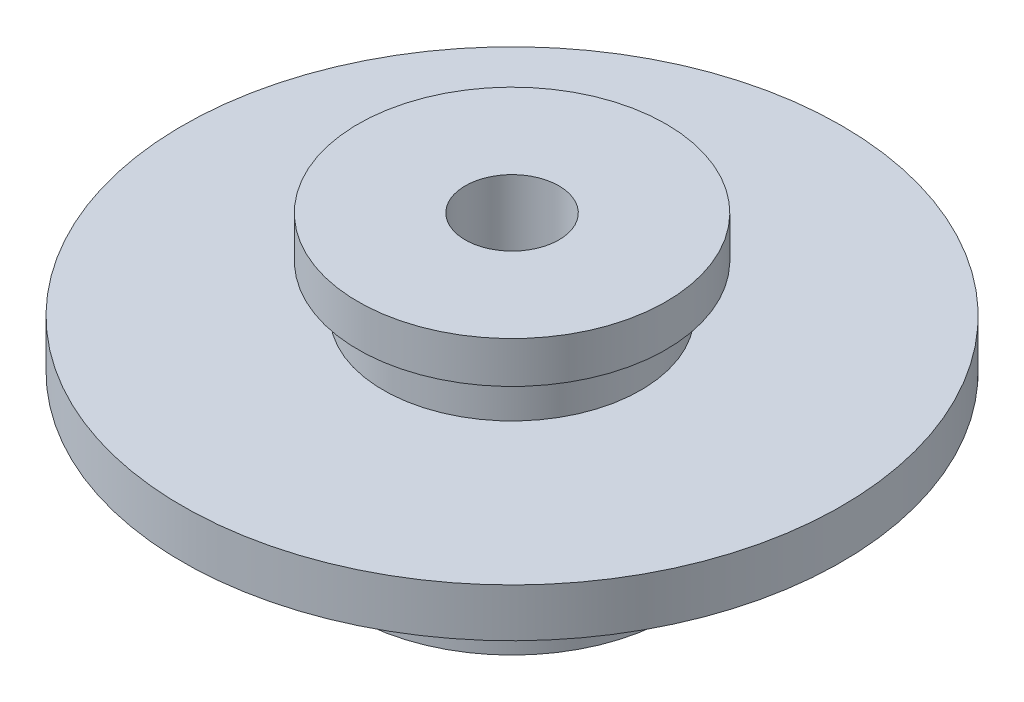
ISO-10303-21;
HEADER;
FILE_DESCRIPTION(('STEP AP214'),'2;1');
FILE_NAME('part.step','',(''),(''),'','','');
FILE_SCHEMA(('AUTOMOTIVE_DESIGN { 1 0 10303 214 1 1 1 1 }'));
ENDSEC;
DATA;
#1=APPLICATION_CONTEXT('core data for automotive mechanical design processes');
#2=APPLICATION_PROTOCOL_DEFINITION('international standard','automotive_design',2000,#1);
#3=PRODUCT_CONTEXT('',#1,'mechanical');
#4=PRODUCT('Part','Part','',(#3));
#5=PRODUCT_RELATED_PRODUCT_CATEGORY('part','',(#4));
#6=PRODUCT_DEFINITION_FORMATION('','',#4);
#7=PRODUCT_DEFINITION_CONTEXT('part definition',#1,'design');
#8=PRODUCT_DEFINITION('design','',#6,#7);
#9=PRODUCT_DEFINITION_SHAPE('','',#8);
#10=(LENGTH_UNIT() NAMED_UNIT(*) SI_UNIT(.MILLI.,.METRE.));
#11=(NAMED_UNIT(*) PLANE_ANGLE_UNIT() SI_UNIT($,.RADIAN.));
#12=(NAMED_UNIT(*) SI_UNIT($,.STERADIAN.) SOLID_ANGLE_UNIT());
#13=UNCERTAINTY_MEASURE_WITH_UNIT(LENGTH_MEASURE(1.E-05),#10,'distance_accuracy_value','');
#14=(GEOMETRIC_REPRESENTATION_CONTEXT(3) GLOBAL_UNCERTAINTY_ASSIGNED_CONTEXT((#13)) GLOBAL_UNIT_ASSIGNED_CONTEXT((#10,
#11,#12)) REPRESENTATION_CONTEXT('',''));
#15=CARTESIAN_POINT('',(0.,0.,0.));
#16=DIRECTION('',(0.,0.,1.));
#17=DIRECTION('',(1.,0.,0.));
#18=AXIS2_PLACEMENT_3D('',#15,#16,#17);
#19=CARTESIAN_POINT('',(5.,0.,0.));
#20=DIRECTION('',(0.,-1.,0.));
#21=DIRECTION('',(0.,0.,-1.));
#22=AXIS2_PLACEMENT_3D('',#19,#20,#21);
#23=PLANE('',#22);
#24=CARTESIAN_POINT('',(0.,0.,0.));
#25=DIRECTION('',(0.,-1.,0.));
#26=DIRECTION('',(0.,0.,-1.));
#27=AXIS2_PLACEMENT_3D('',#24,#25,#26);
#28=CIRCLE('',#27,5.);
#29=CARTESIAN_POINT('',(0.,0.,-5.));
#30=VERTEX_POINT('',#29);
#31=EDGE_CURVE('E73',#30,#30,#28,.T.);
#32=ORIENTED_EDGE('',*,*,#31,.T.);
#33=EDGE_LOOP('',(#32));
#34=FACE_BOUND('',#33,.T.);
#35=CARTESIAN_POINT('',(0.,0.,0.));
#36=DIRECTION('',(0.,-1.,0.));
#37=DIRECTION('',(0.,0.,-1.));
#38=AXIS2_PLACEMENT_3D('',#35,#36,#37);
#39=CIRCLE('',#38,2.92962834273863);
#40=CARTESIAN_POINT('',(0.,0.,-2.92962834273863));
#41=VERTEX_POINT('',#40);
#42=EDGE_CURVE('E10',#41,#41,#39,.T.);
#43=ORIENTED_EDGE('',*,*,#42,.F.);
#44=EDGE_LOOP('',(#43));
#45=FACE_BOUND('',#44,.T.);
#46=ADVANCED_FACE('F33',(#34,#45),#23,.T.);
#47=CARTESIAN_POINT('',(0.,-11.4413902825228,0.));
#48=DIRECTION('',(0.,-1.,0.));
#49=DIRECTION('',(0.,0.,-1.));
#50=AXIS2_PLACEMENT_3D('',#47,#48,#49);
#51=CYLINDRICAL_SURFACE('',#50,2.92962834273863);
#52=ORIENTED_EDGE('',*,*,#42,.T.);
#53=EDGE_LOOP('',(#52));
#54=FACE_BOUND('',#53,.T.);
#55=CARTESIAN_POINT('',(0.,19.8705946083797,0.));
#56=DIRECTION('',(0.,-1.,0.));
#57=DIRECTION('',(0.,0.,-1.));
#58=AXIS2_PLACEMENT_3D('',#55,#56,#57);
#59=CIRCLE('',#58,2.92962834273863);
#60=CARTESIAN_POINT('',(0.,19.8705946083797,-2.92962834273863));
#61=VERTEX_POINT('',#60);
#62=EDGE_CURVE('E39',#61,#61,#59,.T.);
#63=ORIENTED_EDGE('',*,*,#62,.F.);
#64=EDGE_LOOP('',(#63));
#65=FACE_BOUND('',#64,.T.);
#66=ADVANCED_FACE('F91',(#54,#65),#51,.F.);
#67=CARTESIAN_POINT('',(2.92962834273863,19.8705946083797,0.));
#68=DIRECTION('',(0.,1.,0.));
#69=DIRECTION('',(0.,0.,1.));
#70=AXIS2_PLACEMENT_3D('',#67,#68,#69);
#71=PLANE('',#70);
#72=ORIENTED_EDGE('',*,*,#62,.T.);
#73=EDGE_LOOP('',(#72));
#74=FACE_BOUND('',#73,.T.);
#75=CARTESIAN_POINT('',(0.,19.8705946083797,0.));
#76=DIRECTION('',(0.,-1.,0.));
#77=DIRECTION('',(0.,0.,-1.));
#78=AXIS2_PLACEMENT_3D('',#75,#76,#77);
#79=CIRCLE('',#78,9.62481700963569);
#80=CARTESIAN_POINT('',(0.,19.8705946083797,-9.62481700963569));
#81=VERTEX_POINT('',#80);
#82=EDGE_CURVE('E43',#81,#81,#79,.T.);
#83=ORIENTED_EDGE('',*,*,#82,.F.);
#84=EDGE_LOOP('',(#83));
#85=FACE_BOUND('',#84,.T.);
#86=ADVANCED_FACE('F95',(#74,#85),#71,.T.);
#87=CARTESIAN_POINT('',(0.,-11.4413902825228,0.));
#88=DIRECTION('',(0.,-1.,0.));
#89=DIRECTION('',(0.,0.,-1.));
#90=AXIS2_PLACEMENT_3D('',#87,#88,#89);
#91=CYLINDRICAL_SURFACE('',#90,9.62481700963569);
#92=ORIENTED_EDGE('',*,*,#82,.T.);
#93=EDGE_LOOP('',(#92));
#94=FACE_BOUND('',#93,.T.);
#95=CARTESIAN_POINT('',(0.,17.277236909349,0.));
#96=DIRECTION('',(0.,-1.,0.));
#97=DIRECTION('',(0.,0.,-1.));
#98=AXIS2_PLACEMENT_3D('',#95,#96,#97);
#99=CIRCLE('',#98,9.62481700963569);
#100=CARTESIAN_POINT('',(0.,17.277236909349,-9.62481700963569));
#101=VERTEX_POINT('',#100);
#102=EDGE_CURVE('E47',#101,#101,#99,.T.);
#103=ORIENTED_EDGE('',*,*,#102,.F.);
#104=EDGE_LOOP('',(#103));
#105=FACE_BOUND('',#104,.T.);
#106=ADVANCED_FACE('F99',(#94,#105),#91,.T.);
#107=CARTESIAN_POINT('',(9.62481700963569,17.277236909349,0.));
#108=DIRECTION('',(0.,-1.,0.));
#109=DIRECTION('',(0.,0.,-1.));
#110=AXIS2_PLACEMENT_3D('',#107,#108,#109);
#111=PLANE('',#110);
#112=ORIENTED_EDGE('',*,*,#102,.T.);
#113=EDGE_LOOP('',(#112));
#114=FACE_BOUND('',#113,.T.);
#115=CARTESIAN_POINT('',(0.,17.277236909349,0.));
#116=DIRECTION('',(0.,-1.,0.));
#117=DIRECTION('',(0.,0.,-1.));
#118=AXIS2_PLACEMENT_3D('',#115,#116,#117);
#119=CIRCLE('',#118,8.04819040614725);
#120=CARTESIAN_POINT('',(0.,17.277236909349,-8.04819040614725));
#121=VERTEX_POINT('',#120);
#122=EDGE_CURVE('E52',#121,#121,#119,.T.);
#123=ORIENTED_EDGE('',*,*,#122,.F.);
#124=EDGE_LOOP('',(#123));
#125=FACE_BOUND('',#124,.T.);
#126=ADVANCED_FACE('F105',(#114,#125),#111,.T.);
#127=CARTESIAN_POINT('',(0.,-11.4413902825228,0.));
#128=DIRECTION('',(0.,-1.,0.));
#129=DIRECTION('',(0.,0.,-1.));
#130=AXIS2_PLACEMENT_3D('',#127,#128,#129);
#131=CYLINDRICAL_SURFACE('',#130,8.04819040614725);
#132=ORIENTED_EDGE('',*,*,#122,.T.);
#133=EDGE_LOOP('',(#132));
#134=FACE_BOUND('',#133,.T.);
#135=CARTESIAN_POINT('',(0.,14.2942425904275,0.));
#136=DIRECTION('',(0.,-1.,0.));
#137=DIRECTION('',(0.,0.,-1.));
#138=AXIS2_PLACEMENT_3D('',#135,#136,#137);
#139=CIRCLE('',#138,8.04819040614725);
#140=CARTESIAN_POINT('',(0.,14.2942425904275,-8.04819040614725));
#141=VERTEX_POINT('',#140);
#142=EDGE_CURVE('E55',#141,#141,#139,.T.);
#143=ORIENTED_EDGE('',*,*,#142,.F.);
#144=EDGE_LOOP('',(#143));
#145=FACE_BOUND('',#144,.T.);
#146=ADVANCED_FACE('F109',(#134,#145),#131,.T.);
#147=CARTESIAN_POINT('',(8.04819040614725,14.2942425904275,0.));
#148=DIRECTION('',(0.,1.,0.));
#149=DIRECTION('',(0.,0.,1.));
#150=AXIS2_PLACEMENT_3D('',#147,#148,#149);
#151=PLANE('',#150);
#152=ORIENTED_EDGE('',*,*,#142,.T.);
#153=EDGE_LOOP('',(#152));
#154=FACE_BOUND('',#153,.T.);
#155=CARTESIAN_POINT('',(0.,14.2942425904275,0.));
#156=DIRECTION('',(0.,-1.,0.));
#157=DIRECTION('',(0.,0.,-1.));
#158=AXIS2_PLACEMENT_3D('',#155,#156,#157);
#159=CIRCLE('',#158,20.6006670320266);
#160=CARTESIAN_POINT('',(0.,14.2942425904275,-20.6006670320266));
#161=VERTEX_POINT('',#160);
#162=EDGE_CURVE('E58',#161,#161,#159,.T.);
#163=ORIENTED_EDGE('',*,*,#162,.F.);
#164=EDGE_LOOP('',(#163));
#165=FACE_BOUND('',#164,.T.);
#166=ADVANCED_FACE('F113',(#154,#165),#151,.T.);
#167=CARTESIAN_POINT('',(0.,-11.4413902825228,0.));
#168=DIRECTION('',(0.,-1.,0.));
#169=DIRECTION('',(0.,0.,-1.));
#170=AXIS2_PLACEMENT_3D('',#167,#168,#169);
#171=CYLINDRICAL_SURFACE('',#170,20.6006670320266);
#172=ORIENTED_EDGE('',*,*,#162,.T.);
#173=EDGE_LOOP('',(#172));
#174=FACE_BOUND('',#173,.T.);
#175=CARTESIAN_POINT('',(0.,11.2726566294743,0.));
#176=DIRECTION('',(0.,-1.,0.));
#177=DIRECTION('',(0.,0.,-1.));
#178=AXIS2_PLACEMENT_3D('',#175,#176,#177);
#179=CIRCLE('',#178,20.6006670320266);
#180=CARTESIAN_POINT('',(0.,11.2726566294743,-20.6006670320266));
#181=VERTEX_POINT('',#180);
#182=EDGE_CURVE('E61',#181,#181,#179,.T.);
#183=ORIENTED_EDGE('',*,*,#182,.F.);
#184=EDGE_LOOP('',(#183));
#185=FACE_BOUND('',#184,.T.);
#186=ADVANCED_FACE('F117',(#174,#185),#171,.T.);
#187=CARTESIAN_POINT('',(20.6006670320266,11.2726566294743,0.));
#188=DIRECTION('',(0.,-1.,0.));
#189=DIRECTION('',(0.,0.,-1.));
#190=AXIS2_PLACEMENT_3D('',#187,#188,#189);
#191=PLANE('',#190);
#192=ORIENTED_EDGE('',*,*,#182,.T.);
#193=EDGE_LOOP('',(#192));
#194=FACE_BOUND('',#193,.T.);
#195=CARTESIAN_POINT('',(0.,11.2726566294743,0.));
#196=DIRECTION('',(0.,-1.,0.));
#197=DIRECTION('',(0.,0.,-1.));
#198=AXIS2_PLACEMENT_3D('',#195,#196,#197);
#199=CIRCLE('',#198,10.);
#200=CARTESIAN_POINT('',(0.,11.2726566294743,-10.));
#201=VERTEX_POINT('',#200);
#202=EDGE_CURVE('E64',#201,#201,#199,.T.);
#203=ORIENTED_EDGE('',*,*,#202,.F.);
#204=EDGE_LOOP('',(#203));
#205=FACE_BOUND('',#204,.T.);
#206=ADVANCED_FACE('F121',(#194,#205),#191,.T.);
#207=CARTESIAN_POINT('',(0.,-11.4413902825228,0.));
#208=DIRECTION('',(0.,-1.,0.));
#209=DIRECTION('',(0.,0.,-1.));
#210=AXIS2_PLACEMENT_3D('',#207,#208,#209);
#211=CYLINDRICAL_SURFACE('',#210,10.);
#212=ORIENTED_EDGE('',*,*,#202,.T.);
#213=EDGE_LOOP('',(#212));
#214=FACE_BOUND('',#213,.T.);
#215=CARTESIAN_POINT('',(0.,3.,0.));
#216=DIRECTION('',(0.,-1.,0.));
#217=DIRECTION('',(0.,0.,-1.));
#218=AXIS2_PLACEMENT_3D('',#215,#216,#217);
#219=CIRCLE('',#218,10.);
#220=CARTESIAN_POINT('',(0.,3.,-10.));
#221=VERTEX_POINT('',#220);
#222=EDGE_CURVE('E67',#221,#221,#219,.T.);
#223=ORIENTED_EDGE('',*,*,#222,.F.);
#224=EDGE_LOOP('',(#223));
#225=FACE_BOUND('',#224,.T.);
#226=ADVANCED_FACE('F87',(#214,#225),#211,.T.);
#227=CARTESIAN_POINT('',(0.,2.,0.));
#228=DIRECTION('',(0.,1.,0.));
#229=DIRECTION('',(0.,0.,1.));
#230=AXIS2_PLACEMENT_3D('',#227,#228,#229);
#231=CONICAL_SURFACE('',#230,5.,1.37340076694502);
#232=ORIENTED_EDGE('',*,*,#222,.T.);
#233=EDGE_LOOP('',(#232));
#234=FACE_BOUND('',#233,.T.);
#235=CARTESIAN_POINT('',(0.,2.,0.));
#236=DIRECTION('',(0.,-1.,0.));
#237=DIRECTION('',(0.,0.,-1.));
#238=AXIS2_PLACEMENT_3D('',#235,#236,#237);
#239=CIRCLE('',#238,5.);
#240=CARTESIAN_POINT('',(0.,2.,-5.));
#241=VERTEX_POINT('',#240);
#242=EDGE_CURVE('E70',#241,#241,#239,.T.);
#243=ORIENTED_EDGE('',*,*,#242,.F.);
#244=EDGE_LOOP('',(#243));
#245=FACE_BOUND('',#244,.T.);
#246=ADVANCED_FACE('F81',(#234,#245),#231,.T.);
#247=CARTESIAN_POINT('',(0.,-11.4413902825228,0.));
#248=DIRECTION('',(0.,-1.,0.));
#249=DIRECTION('',(0.,0.,-1.));
#250=AXIS2_PLACEMENT_3D('',#247,#248,#249);
#251=CYLINDRICAL_SURFACE('',#250,5.);
#252=ORIENTED_EDGE('',*,*,#242,.T.);
#253=EDGE_LOOP('',(#252));
#254=FACE_BOUND('',#253,.T.);
#255=ORIENTED_EDGE('',*,*,#31,.F.);
#256=EDGE_LOOP('',(#255));
#257=FACE_BOUND('',#256,.T.);
#258=ADVANCED_FACE('F79',(#254,#257),#251,.T.);
#259=CLOSED_SHELL('',(#46,#66,#86,#106,#126,#146,#166,#186,#206,#226,#246,#258));
#260=MANIFOLD_SOLID_BREP('B2',#259);
#261=ADVANCED_BREP_SHAPE_REPRESENTATION('',(#18,#260),#14);
#262=SHAPE_DEFINITION_REPRESENTATION(#9,#261);
ENDSEC;
END-ISO-10303-21;
